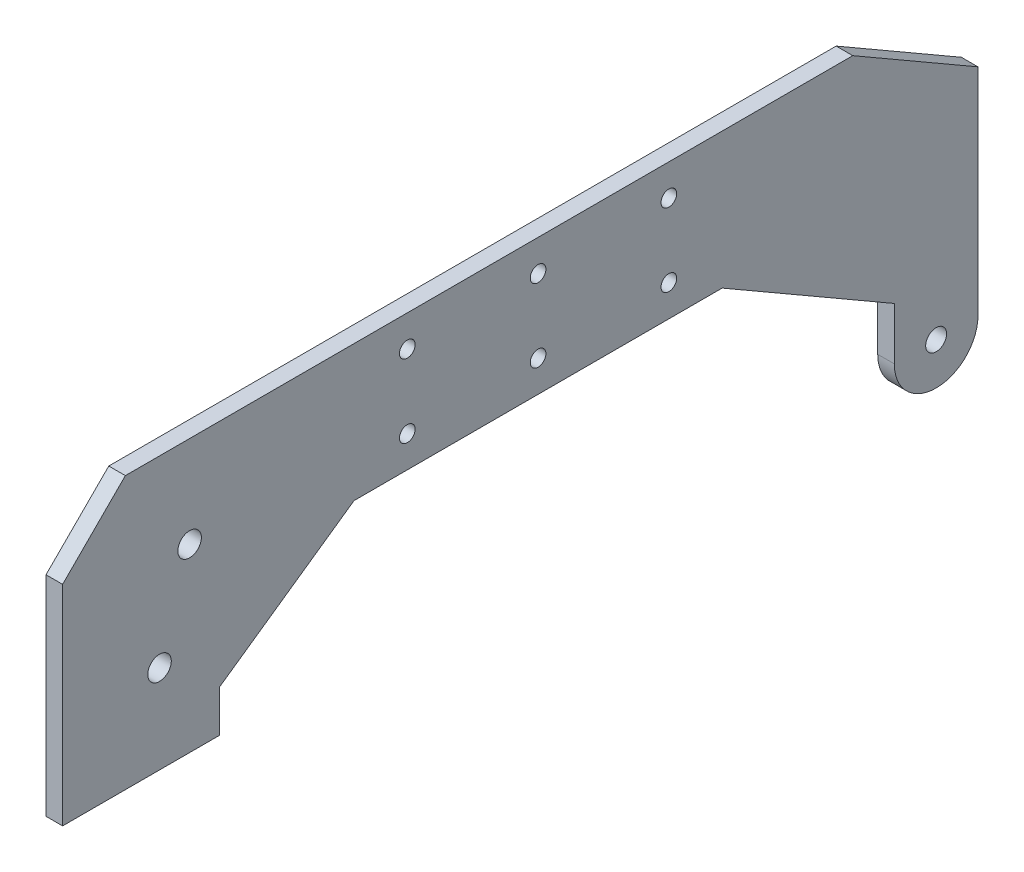
ISO-10303-21;
HEADER;
FILE_DESCRIPTION(('STEP AP214'),'2;1');
FILE_NAME('part.step','',(''),(''),'','','');
FILE_SCHEMA(('AUTOMOTIVE_DESIGN { 1 0 10303 214 1 1 1 1 }'));
ENDSEC;
DATA;
#1=APPLICATION_CONTEXT('core data for automotive mechanical design processes');
#2=APPLICATION_PROTOCOL_DEFINITION('international standard','automotive_design',2000,#1);
#3=PRODUCT_CONTEXT('',#1,'mechanical');
#4=PRODUCT('Part','Part','',(#3));
#5=PRODUCT_RELATED_PRODUCT_CATEGORY('part','',(#4));
#6=PRODUCT_DEFINITION_FORMATION('','',#4);
#7=PRODUCT_DEFINITION_CONTEXT('part definition',#1,'design');
#8=PRODUCT_DEFINITION('design','',#6,#7);
#9=PRODUCT_DEFINITION_SHAPE('','',#8);
#10=(LENGTH_UNIT() NAMED_UNIT(*) SI_UNIT(.MILLI.,.METRE.));
#11=(NAMED_UNIT(*) PLANE_ANGLE_UNIT() SI_UNIT($,.RADIAN.));
#12=(NAMED_UNIT(*) SI_UNIT($,.STERADIAN.) SOLID_ANGLE_UNIT());
#13=UNCERTAINTY_MEASURE_WITH_UNIT(LENGTH_MEASURE(1.E-05),#10,'distance_accuracy_value','');
#14=(GEOMETRIC_REPRESENTATION_CONTEXT(3) GLOBAL_UNCERTAINTY_ASSIGNED_CONTEXT((#13)) GLOBAL_UNIT_ASSIGNED_CONTEXT((#10,
#11,#12)) REPRESENTATION_CONTEXT('',''));
#15=CARTESIAN_POINT('',(0.,0.,0.));
#16=DIRECTION('',(0.,0.,1.));
#17=DIRECTION('',(1.,0.,0.));
#18=AXIS2_PLACEMENT_3D('',#15,#16,#17);
#19=CARTESIAN_POINT('',(3.175,156.62081069656,368.186352930623));
#20=DIRECTION('',(1.,0.,0.));
#21=DIRECTION('',(0.,0.,-1.));
#22=AXIS2_PLACEMENT_3D('',#19,#20,#21);
#23=PLANE('',#22);
#24=CARTESIAN_POINT('',(3.175,191.620810696557,469.287503541848));
#25=DIRECTION('',(1.,0.,0.));
#26=DIRECTION('',(0.,0.,-1.));
#27=AXIS2_PLACEMENT_3D('',#24,#25,#26);
#28=CIRCLE('',#27,1.50000000000374);
#29=CARTESIAN_POINT('',(3.175,191.620810696557,467.787503541845));
#30=VERTEX_POINT('',#29);
#31=EDGE_CURVE('E315',#30,#30,#28,.T.);
#32=ORIENTED_EDGE('',*,*,#31,.F.);
#33=EDGE_LOOP('',(#32));
#34=FACE_BOUND('',#33,.T.);
#35=CARTESIAN_POINT('',(3.175,205.620810696559,469.287503541848));
#36=DIRECTION('',(1.,0.,0.));
#37=DIRECTION('',(0.,0.,-1.));
#38=AXIS2_PLACEMENT_3D('',#35,#36,#37);
#39=CIRCLE('',#38,1.50000000000275);
#40=CARTESIAN_POINT('',(3.175,205.620810696559,467.787503541845));
#41=VERTEX_POINT('',#40);
#42=EDGE_CURVE('E327',#41,#41,#39,.T.);
#43=ORIENTED_EDGE('',*,*,#42,.F.);
#44=EDGE_LOOP('',(#43));
#45=FACE_BOUND('',#44,.T.);
#46=CARTESIAN_POINT('',(3.175,191.620810696557,444.287503541848));
#47=DIRECTION('',(1.,0.,0.));
#48=DIRECTION('',(0.,0.,-1.));
#49=AXIS2_PLACEMENT_3D('',#46,#47,#48);
#50=CIRCLE('',#49,1.50000000000275);
#51=CARTESIAN_POINT('',(3.175,191.620810696557,442.787503541845));
#52=VERTEX_POINT('',#51);
#53=EDGE_CURVE('E339',#52,#52,#50,.T.);
#54=ORIENTED_EDGE('',*,*,#53,.F.);
#55=EDGE_LOOP('',(#54));
#56=FACE_BOUND('',#55,.T.);
#57=CARTESIAN_POINT('',(3.175,194.119148630694,510.908050144466));
#58=DIRECTION('',(1.,0.,0.));
#59=DIRECTION('',(0.,0.,-1.));
#60=AXIS2_PLACEMENT_3D('',#57,#58,#59);
#61=CIRCLE('',#60,2.25000000000048);
#62=CARTESIAN_POINT('',(3.175,194.119148630694,508.658050144465));
#63=VERTEX_POINT('',#62);
#64=EDGE_CURVE('E351',#63,#63,#61,.T.);
#65=ORIENTED_EDGE('',*,*,#64,.F.);
#66=EDGE_LOOP('',(#65));
#67=FACE_BOUND('',#66,.T.);
#68=DIRECTION('',(0.,0.,-1.));
#69=VECTOR('',#68,1.);
#70=CARTESIAN_POINT('',(3.175,159.62081069656,505.186352930625));
#71=LINE('',#70,#69);
#72=CARTESIAN_POINT('',(3.175,159.62081069656,535.186352930625));
#73=VERTEX_POINT('',#72);
#74=CARTESIAN_POINT('',(3.175,159.62081069656,505.186352930625));
#75=VERTEX_POINT('',#74);
#76=EDGE_CURVE('E181',#73,#75,#71,.T.);
#77=ORIENTED_EDGE('',*,*,#76,.T.);
#78=DIRECTION('',(0.,1.,0.));
#79=VECTOR('',#78,1.);
#80=CARTESIAN_POINT('',(3.175,167.62081069656,505.186352930625));
#81=LINE('',#80,#79);
#82=CARTESIAN_POINT('',(3.175,167.62081069656,505.186352930625));
#83=VERTEX_POINT('',#82);
#84=EDGE_CURVE('E109',#75,#83,#81,.T.);
#85=ORIENTED_EDGE('',*,*,#84,.T.);
#86=DIRECTION('',(0.,0.573576436351051,-0.819152044288989));
#87=VECTOR('',#86,1.);
#88=CARTESIAN_POINT('',(3.175,167.62081069656,505.186352930625));
#89=LINE('',#88,#87);
#90=CARTESIAN_POINT('',(3.175,185.620810696557,479.479688809272));
#91=VERTEX_POINT('',#90);
#92=EDGE_CURVE('E208',#83,#91,#89,.T.);
#93=ORIENTED_EDGE('',*,*,#92,.T.);
#94=DIRECTION('',(0.,0.,-1.));
#95=VECTOR('',#94,1.);
#96=CARTESIAN_POINT('',(3.175,185.620810696557,479.479688809272));
#97=LINE('',#96,#95);
#98=CARTESIAN_POINT('',(3.175,185.620810696557,409.095318274426));
#99=VERTEX_POINT('',#98);
#100=EDGE_CURVE('E227',#91,#99,#97,.T.);
#101=ORIENTED_EDGE('',*,*,#100,.T.);
#102=DIRECTION('',(0.,-0.500000000000002,-0.866025403784437));
#103=VECTOR('',#102,1.);
#104=CARTESIAN_POINT('',(3.175,185.620810696557,409.095318274426));
#105=LINE('',#104,#103);
#106=CARTESIAN_POINT('',(3.175,166.62081069656,376.186352930623));
#107=VERTEX_POINT('',#106);
#108=EDGE_CURVE('E224',#99,#107,#105,.T.);
#109=ORIENTED_EDGE('',*,*,#108,.T.);
#110=DIRECTION('',(0.,-1.,0.));
#111=VECTOR('',#110,1.);
#112=CARTESIAN_POINT('',(3.175,156.62081069656,376.186352930623));
#113=LINE('',#112,#111);
#114=CARTESIAN_POINT('',(3.175,156.62081069656,376.186352930623));
#115=VERTEX_POINT('',#114);
#116=EDGE_CURVE('E226',#107,#115,#113,.T.);
#117=ORIENTED_EDGE('',*,*,#116,.T.);
#118=CARTESIAN_POINT('',(3.175,156.62081069656,368.186352930623));
#119=DIRECTION('',(1.,0.,0.));
#120=DIRECTION('',(0.,0.,-1.));
#121=AXIS2_PLACEMENT_3D('',#118,#119,#120);
#122=CIRCLE('',#121,7.99999999999923);
#123=CARTESIAN_POINT('',(3.175,156.62081069656,360.186352930625));
#124=VERTEX_POINT('',#123);
#125=EDGE_CURVE('E229',#115,#124,#122,.T.);
#126=ORIENTED_EDGE('',*,*,#125,.T.);
#127=DIRECTION('',(0.,1.,0.));
#128=VECTOR('',#127,1.);
#129=CARTESIAN_POINT('',(3.175,197.797725232797,360.186352930625));
#130=LINE('',#129,#128);
#131=CARTESIAN_POINT('',(3.175,197.797725232797,360.186352930625));
#132=VERTEX_POINT('',#131);
#133=EDGE_CURVE('E235',#124,#132,#130,.T.);
#134=ORIENTED_EDGE('',*,*,#133,.T.);
#135=DIRECTION('',(0.,0.500000000000003,0.866025403784437));
#136=VECTOR('',#135,1.);
#137=CARTESIAN_POINT('',(3.175,211.62081069656,384.128639271229));
#138=LINE('',#137,#136);
#139=CARTESIAN_POINT('',(3.175,211.62081069656,384.128639271229));
#140=VERTEX_POINT('',#139);
#141=EDGE_CURVE('E140',#132,#140,#138,.T.);
#142=ORIENTED_EDGE('',*,*,#141,.T.);
#143=DIRECTION('',(0.,0.,1.));
#144=VECTOR('',#143,1.);
#145=CARTESIAN_POINT('',(3.175,211.62081069656,384.128639271229));
#146=LINE('',#145,#144);
#147=CARTESIAN_POINT('',(3.175,211.62081069656,523.186352930625));
#148=VERTEX_POINT('',#147);
#149=EDGE_CURVE('E134',#140,#148,#146,.T.);
#150=ORIENTED_EDGE('',*,*,#149,.T.);
#151=DIRECTION('',(0.,-0.707106781186548,0.707106781186547));
#152=VECTOR('',#151,1.);
#153=CARTESIAN_POINT('',(3.175,211.62081069656,523.186352930625));
#154=LINE('',#153,#152);
#155=CARTESIAN_POINT('',(3.175,199.62081069656,535.186352930625));
#156=VERTEX_POINT('',#155);
#157=EDGE_CURVE('E138',#148,#156,#154,.T.);
#158=ORIENTED_EDGE('',*,*,#157,.T.);
#159=DIRECTION('',(0.,-1.,0.));
#160=VECTOR('',#159,1.);
#161=CARTESIAN_POINT('',(3.175,199.62081069656,535.186352930625));
#162=LINE('',#161,#160);
#163=EDGE_CURVE('E54',#156,#73,#162,.T.);
#164=ORIENTED_EDGE('',*,*,#163,.T.);
#165=EDGE_LOOP('',(#77,#85,#93,#101,#109,#117,#126,#134,#142,#150,#158,#164));
#166=FACE_BOUND('',#165,.T.);
#167=CARTESIAN_POINT('',(3.175,156.62081069656,368.186352930623));
#168=DIRECTION('',(1.,0.,0.));
#169=DIRECTION('',(0.,0.,-1.));
#170=AXIS2_PLACEMENT_3D('',#167,#168,#169);
#171=CIRCLE('',#170,2.);
#172=CARTESIAN_POINT('',(3.175,156.62081069656,366.186352930623));
#173=VERTEX_POINT('',#172);
#174=EDGE_CURVE('E162',#173,#173,#171,.T.);
#175=ORIENTED_EDGE('',*,*,#174,.F.);
#176=EDGE_LOOP('',(#175));
#177=FACE_BOUND('',#176,.T.);
#178=CARTESIAN_POINT('',(3.175,176.534985114945,516.656718986153));
#179=DIRECTION('',(1.,0.,0.));
#180=DIRECTION('',(0.,0.,-1.));
#181=AXIS2_PLACEMENT_3D('',#178,#179,#180);
#182=CIRCLE('',#181,2.25000000000048);
#183=CARTESIAN_POINT('',(3.175,176.534985114945,514.406718986152));
#184=VERTEX_POINT('',#183);
#185=EDGE_CURVE('E345',#184,#184,#182,.T.);
#186=ORIENTED_EDGE('',*,*,#185,.F.);
#187=EDGE_LOOP('',(#186));
#188=FACE_BOUND('',#187,.T.);
#189=CARTESIAN_POINT('',(3.175,191.620810696557,419.287503541848));
#190=DIRECTION('',(1.,0.,0.));
#191=DIRECTION('',(0.,0.,-1.));
#192=AXIS2_PLACEMENT_3D('',#189,#190,#191);
#193=CIRCLE('',#192,1.500000000002);
#194=CARTESIAN_POINT('',(3.175,191.620810696557,417.787503541846));
#195=VERTEX_POINT('',#194);
#196=EDGE_CURVE('E333',#195,#195,#193,.T.);
#197=ORIENTED_EDGE('',*,*,#196,.F.);
#198=EDGE_LOOP('',(#197));
#199=FACE_BOUND('',#198,.T.);
#200=CARTESIAN_POINT('',(3.175,205.620810696559,419.287503541848));
#201=DIRECTION('',(1.,0.,0.));
#202=DIRECTION('',(0.,0.,-1.));
#203=AXIS2_PLACEMENT_3D('',#200,#201,#202);
#204=CIRCLE('',#203,1.500000000002);
#205=CARTESIAN_POINT('',(3.175,205.620810696559,417.787503541846));
#206=VERTEX_POINT('',#205);
#207=EDGE_CURVE('E321',#206,#206,#204,.T.);
#208=ORIENTED_EDGE('',*,*,#207,.F.);
#209=EDGE_LOOP('',(#208));
#210=FACE_BOUND('',#209,.T.);
#211=CARTESIAN_POINT('',(3.175,205.620810696559,444.287503541848));
#212=DIRECTION('',(1.,0.,0.));
#213=DIRECTION('',(0.,0.,-1.));
#214=AXIS2_PLACEMENT_3D('',#211,#212,#213);
#215=CIRCLE('',#214,1.50000000000275);
#216=CARTESIAN_POINT('',(3.175,205.620810696559,442.787503541845));
#217=VERTEX_POINT('',#216);
#218=EDGE_CURVE('E306',#217,#217,#215,.T.);
#219=ORIENTED_EDGE('',*,*,#218,.F.);
#220=EDGE_LOOP('',(#219));
#221=FACE_BOUND('',#220,.T.);
#222=ADVANCED_FACE('F37',(#34,#45,#56,#67,#166,#177,#188,#199,#210,#221),#23,.T.);
#223=CARTESIAN_POINT('',(0.,156.62081069656,368.186352930623));
#224=DIRECTION('',(1.,0.,0.));
#225=DIRECTION('',(0.,0.,-1.));
#226=AXIS2_PLACEMENT_3D('',#223,#224,#225);
#227=PLANE('',#226);
#228=DIRECTION('',(0.,0.,-1.));
#229=VECTOR('',#228,1.);
#230=CARTESIAN_POINT('',(0.,159.62081069656,505.186352930625));
#231=LINE('',#230,#229);
#232=CARTESIAN_POINT('',(0.,159.62081069656,535.186352930625));
#233=VERTEX_POINT('',#232);
#234=CARTESIAN_POINT('',(0.,159.62081069656,505.186352930625));
#235=VERTEX_POINT('',#234);
#236=EDGE_CURVE('E158',#233,#235,#231,.T.);
#237=ORIENTED_EDGE('',*,*,#236,.F.);
#238=DIRECTION('',(0.,-1.,0.));
#239=VECTOR('',#238,1.);
#240=CARTESIAN_POINT('',(0.,199.62081069656,535.186352930625));
#241=LINE('',#240,#239);
#242=CARTESIAN_POINT('',(0.,199.62081069656,535.186352930625));
#243=VERTEX_POINT('',#242);
#244=EDGE_CURVE('E101',#243,#233,#241,.T.);
#245=ORIENTED_EDGE('',*,*,#244,.F.);
#246=DIRECTION('',(0.,-0.707106781186548,0.707106781186547));
#247=VECTOR('',#246,1.);
#248=CARTESIAN_POINT('',(0.,211.62081069656,523.186352930625));
#249=LINE('',#248,#247);
#250=CARTESIAN_POINT('',(0.,211.62081069656,523.186352930625));
#251=VERTEX_POINT('',#250);
#252=EDGE_CURVE('E95',#251,#243,#249,.T.);
#253=ORIENTED_EDGE('',*,*,#252,.F.);
#254=DIRECTION('',(0.,0.,1.));
#255=VECTOR('',#254,1.);
#256=CARTESIAN_POINT('',(0.,211.62081069656,384.128639271229));
#257=LINE('',#256,#255);
#258=CARTESIAN_POINT('',(0.,211.62081069656,384.128639271229));
#259=VERTEX_POINT('',#258);
#260=EDGE_CURVE('E148',#259,#251,#257,.T.);
#261=ORIENTED_EDGE('',*,*,#260,.F.);
#262=DIRECTION('',(0.,0.500000000000003,0.866025403784437));
#263=VECTOR('',#262,1.);
#264=CARTESIAN_POINT('',(0.,211.62081069656,384.128639271229));
#265=LINE('',#264,#263);
#266=CARTESIAN_POINT('',(0.,197.797725232797,360.186352930625));
#267=VERTEX_POINT('',#266);
#268=EDGE_CURVE('E176',#267,#259,#265,.T.);
#269=ORIENTED_EDGE('',*,*,#268,.F.);
#270=DIRECTION('',(0.,1.,0.));
#271=VECTOR('',#270,1.);
#272=CARTESIAN_POINT('',(0.,197.797725232797,360.186352930625));
#273=LINE('',#272,#271);
#274=CARTESIAN_POINT('',(0.,156.62081069656,360.186352930625));
#275=VERTEX_POINT('',#274);
#276=EDGE_CURVE('E174',#275,#267,#273,.T.);
#277=ORIENTED_EDGE('',*,*,#276,.F.);
#278=CARTESIAN_POINT('',(0.,156.62081069656,368.186352930623));
#279=DIRECTION('',(1.,0.,0.));
#280=DIRECTION('',(0.,0.,-1.));
#281=AXIS2_PLACEMENT_3D('',#278,#279,#280);
#282=CIRCLE('',#281,7.99999999999923);
#283=CARTESIAN_POINT('',(0.,156.62081069656,376.186352930623));
#284=VERTEX_POINT('',#283);
#285=EDGE_CURVE('E172',#284,#275,#282,.T.);
#286=ORIENTED_EDGE('',*,*,#285,.F.);
#287=DIRECTION('',(0.,-1.,0.));
#288=VECTOR('',#287,1.);
#289=CARTESIAN_POINT('',(0.,156.62081069656,376.186352930623));
#290=LINE('',#289,#288);
#291=CARTESIAN_POINT('',(0.,166.62081069656,376.186352930623));
#292=VERTEX_POINT('',#291);
#293=EDGE_CURVE('E170',#292,#284,#290,.T.);
#294=ORIENTED_EDGE('',*,*,#293,.F.);
#295=DIRECTION('',(0.,-0.500000000000002,-0.866025403784437));
#296=VECTOR('',#295,1.);
#297=CARTESIAN_POINT('',(0.,185.620810696557,409.095318274426));
#298=LINE('',#297,#296);
#299=CARTESIAN_POINT('',(0.,185.620810696557,409.095318274426));
#300=VERTEX_POINT('',#299);
#301=EDGE_CURVE('E168',#300,#292,#298,.T.);
#302=ORIENTED_EDGE('',*,*,#301,.F.);
#303=DIRECTION('',(0.,0.,-1.));
#304=VECTOR('',#303,1.);
#305=CARTESIAN_POINT('',(0.,185.620810696557,479.479688809272));
#306=LINE('',#305,#304);
#307=CARTESIAN_POINT('',(0.,185.620810696557,479.479688809272));
#308=VERTEX_POINT('',#307);
#309=EDGE_CURVE('E166',#308,#300,#306,.T.);
#310=ORIENTED_EDGE('',*,*,#309,.F.);
#311=DIRECTION('',(0.,0.573576436351051,-0.819152044288989));
#312=VECTOR('',#311,1.);
#313=CARTESIAN_POINT('',(0.,167.62081069656,505.186352930625));
#314=LINE('',#313,#312);
#315=CARTESIAN_POINT('',(0.,167.62081069656,505.186352930625));
#316=VERTEX_POINT('',#315);
#317=EDGE_CURVE('E164',#316,#308,#314,.T.);
#318=ORIENTED_EDGE('',*,*,#317,.F.);
#319=DIRECTION('',(0.,1.,0.));
#320=VECTOR('',#319,1.);
#321=CARTESIAN_POINT('',(0.,167.62081069656,505.186352930625));
#322=LINE('',#321,#320);
#323=EDGE_CURVE('E161',#235,#316,#322,.T.);
#324=ORIENTED_EDGE('',*,*,#323,.F.);
#325=EDGE_LOOP('',(#237,#245,#253,#261,#269,#277,#286,#294,#302,#310,#318,#324));
#326=FACE_BOUND('',#325,.T.);
#327=CARTESIAN_POINT('',(0.,156.62081069656,368.186352930623));
#328=DIRECTION('',(1.,0.,0.));
#329=DIRECTION('',(0.,0.,-1.));
#330=AXIS2_PLACEMENT_3D('',#327,#328,#329);
#331=CIRCLE('',#330,2.);
#332=CARTESIAN_POINT('',(0.,156.62081069656,366.186352930623));
#333=VERTEX_POINT('',#332);
#334=EDGE_CURVE('E354',#333,#333,#331,.T.);
#335=ORIENTED_EDGE('',*,*,#334,.T.);
#336=EDGE_LOOP('',(#335));
#337=FACE_BOUND('',#336,.T.);
#338=CARTESIAN_POINT('',(0.,194.119148630694,510.908050144466));
#339=DIRECTION('',(1.,0.,0.));
#340=DIRECTION('',(0.,0.,-1.));
#341=AXIS2_PLACEMENT_3D('',#338,#339,#340);
#342=CIRCLE('',#341,2.25000000000048);
#343=CARTESIAN_POINT('',(0.,194.119148630694,508.658050144465));
#344=VERTEX_POINT('',#343);
#345=EDGE_CURVE('E348',#344,#344,#342,.T.);
#346=ORIENTED_EDGE('',*,*,#345,.T.);
#347=EDGE_LOOP('',(#346));
#348=FACE_BOUND('',#347,.T.);
#349=CARTESIAN_POINT('',(0.,176.534985114945,516.656718986153));
#350=DIRECTION('',(1.,0.,0.));
#351=DIRECTION('',(0.,0.,-1.));
#352=AXIS2_PLACEMENT_3D('',#349,#350,#351);
#353=CIRCLE('',#352,2.25000000000048);
#354=CARTESIAN_POINT('',(0.,176.534985114945,514.406718986152));
#355=VERTEX_POINT('',#354);
#356=EDGE_CURVE('E342',#355,#355,#353,.T.);
#357=ORIENTED_EDGE('',*,*,#356,.T.);
#358=EDGE_LOOP('',(#357));
#359=FACE_BOUND('',#358,.T.);
#360=CARTESIAN_POINT('',(0.,191.620810696557,444.287503541848));
#361=DIRECTION('',(1.,0.,0.));
#362=DIRECTION('',(0.,0.,-1.));
#363=AXIS2_PLACEMENT_3D('',#360,#361,#362);
#364=CIRCLE('',#363,1.50000000000275);
#365=CARTESIAN_POINT('',(0.,191.620810696557,442.787503541845));
#366=VERTEX_POINT('',#365);
#367=EDGE_CURVE('E336',#366,#366,#364,.T.);
#368=ORIENTED_EDGE('',*,*,#367,.T.);
#369=EDGE_LOOP('',(#368));
#370=FACE_BOUND('',#369,.T.);
#371=CARTESIAN_POINT('',(0.,191.620810696557,419.287503541848));
#372=DIRECTION('',(1.,0.,0.));
#373=DIRECTION('',(0.,0.,-1.));
#374=AXIS2_PLACEMENT_3D('',#371,#372,#373);
#375=CIRCLE('',#374,1.500000000002);
#376=CARTESIAN_POINT('',(0.,191.620810696557,417.787503541846));
#377=VERTEX_POINT('',#376);
#378=EDGE_CURVE('E330',#377,#377,#375,.T.);
#379=ORIENTED_EDGE('',*,*,#378,.T.);
#380=EDGE_LOOP('',(#379));
#381=FACE_BOUND('',#380,.T.);
#382=CARTESIAN_POINT('',(0.,205.620810696559,469.287503541848));
#383=DIRECTION('',(1.,0.,0.));
#384=DIRECTION('',(0.,0.,-1.));
#385=AXIS2_PLACEMENT_3D('',#382,#383,#384);
#386=CIRCLE('',#385,1.50000000000275);
#387=CARTESIAN_POINT('',(0.,205.620810696559,467.787503541845));
#388=VERTEX_POINT('',#387);
#389=EDGE_CURVE('E324',#388,#388,#386,.T.);
#390=ORIENTED_EDGE('',*,*,#389,.T.);
#391=EDGE_LOOP('',(#390));
#392=FACE_BOUND('',#391,.T.);
#393=CARTESIAN_POINT('',(0.,205.620810696559,419.287503541848));
#394=DIRECTION('',(1.,0.,0.));
#395=DIRECTION('',(0.,0.,-1.));
#396=AXIS2_PLACEMENT_3D('',#393,#394,#395);
#397=CIRCLE('',#396,1.500000000002);
#398=CARTESIAN_POINT('',(0.,205.620810696559,417.787503541846));
#399=VERTEX_POINT('',#398);
#400=EDGE_CURVE('E318',#399,#399,#397,.T.);
#401=ORIENTED_EDGE('',*,*,#400,.T.);
#402=EDGE_LOOP('',(#401));
#403=FACE_BOUND('',#402,.T.);
#404=CARTESIAN_POINT('',(0.,191.620810696557,469.287503541848));
#405=DIRECTION('',(1.,0.,0.));
#406=DIRECTION('',(0.,0.,-1.));
#407=AXIS2_PLACEMENT_3D('',#404,#405,#406);
#408=CIRCLE('',#407,1.50000000000374);
#409=CARTESIAN_POINT('',(0.,191.620810696557,467.787503541845));
#410=VERTEX_POINT('',#409);
#411=EDGE_CURVE('E312',#410,#410,#408,.T.);
#412=ORIENTED_EDGE('',*,*,#411,.T.);
#413=EDGE_LOOP('',(#412));
#414=FACE_BOUND('',#413,.T.);
#415=CARTESIAN_POINT('',(0.,205.620810696559,444.287503541848));
#416=DIRECTION('',(1.,0.,0.));
#417=DIRECTION('',(0.,0.,-1.));
#418=AXIS2_PLACEMENT_3D('',#415,#416,#417);
#419=CIRCLE('',#418,1.50000000000275);
#420=CARTESIAN_POINT('',(0.,205.620810696559,442.787503541845));
#421=VERTEX_POINT('',#420);
#422=EDGE_CURVE('E309',#421,#421,#419,.T.);
#423=ORIENTED_EDGE('',*,*,#422,.T.);
#424=EDGE_LOOP('',(#423));
#425=FACE_BOUND('',#424,.T.);
#426=ADVANCED_FACE('F212',(#326,#337,#348,#359,#370,#381,#392,#403,#414,#425),#227,.F.);
#427=CARTESIAN_POINT('',(3.175,159.62081069656,505.186352930625));
#428=DIRECTION('',(0.,1.,0.));
#429=DIRECTION('',(0.,0.,1.));
#430=AXIS2_PLACEMENT_3D('',#427,#428,#429);
#431=PLANE('',#430);
#432=ORIENTED_EDGE('',*,*,#236,.T.);
#433=DIRECTION('',(-1.,0.,0.));
#434=VECTOR('',#433,1.);
#435=CARTESIAN_POINT('',(3.175,159.62081069656,505.186352930625));
#436=LINE('',#435,#434);
#437=EDGE_CURVE('E11',#75,#235,#436,.T.);
#438=ORIENTED_EDGE('',*,*,#437,.F.);
#439=ORIENTED_EDGE('',*,*,#76,.F.);
#440=DIRECTION('',(-1.,0.,0.));
#441=VECTOR('',#440,1.);
#442=CARTESIAN_POINT('',(3.175,159.62081069656,535.186352930625));
#443=LINE('',#442,#441);
#444=EDGE_CURVE('E154',#73,#233,#443,.T.);
#445=ORIENTED_EDGE('',*,*,#444,.T.);
#446=EDGE_LOOP('',(#432,#438,#439,#445));
#447=FACE_BOUND('',#446,.T.);
#448=ADVANCED_FACE('F39',(#447),#431,.F.);
#449=CARTESIAN_POINT('',(3.175,167.62081069656,505.186352930625));
#450=DIRECTION('',(0.,0.,1.));
#451=DIRECTION('',(1.,0.,0.));
#452=AXIS2_PLACEMENT_3D('',#449,#450,#451);
#453=PLANE('',#452);
#454=ORIENTED_EDGE('',*,*,#323,.T.);
#455=DIRECTION('',(-1.,0.,0.));
#456=VECTOR('',#455,1.);
#457=CARTESIAN_POINT('',(3.175,167.62081069656,505.186352930625));
#458=LINE('',#457,#456);
#459=EDGE_CURVE('E46',#83,#316,#458,.T.);
#460=ORIENTED_EDGE('',*,*,#459,.F.);
#461=ORIENTED_EDGE('',*,*,#84,.F.);
#462=ORIENTED_EDGE('',*,*,#437,.T.);
#463=EDGE_LOOP('',(#454,#460,#461,#462));
#464=FACE_BOUND('',#463,.T.);
#465=ADVANCED_FACE('F519',(#464),#453,.F.);
#466=CARTESIAN_POINT('',(3.175,167.62081069656,505.186352930625));
#467=DIRECTION('',(0.,0.819152044288989,0.573576436351051));
#468=DIRECTION('',(0.,-0.573576436351051,0.819152044288989));
#469=AXIS2_PLACEMENT_3D('',#466,#467,#468);
#470=PLANE('',#469);
#471=ORIENTED_EDGE('',*,*,#317,.T.);
#472=DIRECTION('',(-1.,0.,0.));
#473=VECTOR('',#472,1.);
#474=CARTESIAN_POINT('',(3.175,185.620810696557,479.479688809272));
#475=LINE('',#474,#473);
#476=EDGE_CURVE('E200',#91,#308,#475,.T.);
#477=ORIENTED_EDGE('',*,*,#476,.F.);
#478=ORIENTED_EDGE('',*,*,#92,.F.);
#479=ORIENTED_EDGE('',*,*,#459,.T.);
#480=EDGE_LOOP('',(#471,#477,#478,#479));
#481=FACE_BOUND('',#480,.T.);
#482=ADVANCED_FACE('F206',(#481),#470,.F.);
#483=CARTESIAN_POINT('',(3.175,185.620810696557,479.479688809272));
#484=DIRECTION('',(0.,1.,0.));
#485=DIRECTION('',(0.,0.,1.));
#486=AXIS2_PLACEMENT_3D('',#483,#484,#485);
#487=PLANE('',#486);
#488=ORIENTED_EDGE('',*,*,#309,.T.);
#489=DIRECTION('',(-1.,0.,0.));
#490=VECTOR('',#489,1.);
#491=CARTESIAN_POINT('',(3.175,185.620810696557,409.095318274426));
#492=LINE('',#491,#490);
#493=EDGE_CURVE('E197',#99,#300,#492,.T.);
#494=ORIENTED_EDGE('',*,*,#493,.F.);
#495=ORIENTED_EDGE('',*,*,#100,.F.);
#496=ORIENTED_EDGE('',*,*,#476,.T.);
#497=EDGE_LOOP('',(#488,#494,#495,#496));
#498=FACE_BOUND('',#497,.T.);
#499=ADVANCED_FACE('F218',(#498),#487,.F.);
#500=CARTESIAN_POINT('',(3.175,185.620810696557,409.095318274426));
#501=DIRECTION('',(0.,0.866025403784437,-0.500000000000002));
#502=DIRECTION('',(0.,0.500000000000002,0.866025403784437));
#503=AXIS2_PLACEMENT_3D('',#500,#501,#502);
#504=PLANE('',#503);
#505=ORIENTED_EDGE('',*,*,#301,.T.);
#506=DIRECTION('',(-1.,0.,0.));
#507=VECTOR('',#506,1.);
#508=CARTESIAN_POINT('',(3.175,166.62081069656,376.186352930623));
#509=LINE('',#508,#507);
#510=EDGE_CURVE('E194',#107,#292,#509,.T.);
#511=ORIENTED_EDGE('',*,*,#510,.F.);
#512=ORIENTED_EDGE('',*,*,#108,.F.);
#513=ORIENTED_EDGE('',*,*,#493,.T.);
#514=EDGE_LOOP('',(#505,#511,#512,#513));
#515=FACE_BOUND('',#514,.T.);
#516=ADVANCED_FACE('F222',(#515),#504,.F.);
#517=CARTESIAN_POINT('',(3.175,156.62081069656,376.186352930623));
#518=DIRECTION('',(0.,0.,-1.));
#519=DIRECTION('',(-1.,0.,0.));
#520=AXIS2_PLACEMENT_3D('',#517,#518,#519);
#521=PLANE('',#520);
#522=ORIENTED_EDGE('',*,*,#293,.T.);
#523=DIRECTION('',(-1.,0.,0.));
#524=VECTOR('',#523,1.);
#525=CARTESIAN_POINT('',(3.175,156.62081069656,376.186352930623));
#526=LINE('',#525,#524);
#527=EDGE_CURVE('E191',#115,#284,#526,.T.);
#528=ORIENTED_EDGE('',*,*,#527,.F.);
#529=ORIENTED_EDGE('',*,*,#116,.F.);
#530=ORIENTED_EDGE('',*,*,#510,.T.);
#531=EDGE_LOOP('',(#522,#528,#529,#530));
#532=FACE_BOUND('',#531,.T.);
#533=ADVANCED_FACE('F480',(#532),#521,.F.);
#534=CARTESIAN_POINT('',(3.175,156.62081069656,368.186352930623));
#535=DIRECTION('',(-1.,0.,0.));
#536=DIRECTION('',(0.,0.,1.));
#537=AXIS2_PLACEMENT_3D('',#534,#535,#536);
#538=CYLINDRICAL_SURFACE('',#537,7.99999999999923);
#539=ORIENTED_EDGE('',*,*,#285,.T.);
#540=DIRECTION('',(-1.,0.,0.));
#541=VECTOR('',#540,1.);
#542=CARTESIAN_POINT('',(3.175,156.62081069656,360.186352930625));
#543=LINE('',#542,#541);
#544=EDGE_CURVE('E188',#124,#275,#543,.T.);
#545=ORIENTED_EDGE('',*,*,#544,.F.);
#546=ORIENTED_EDGE('',*,*,#125,.F.);
#547=ORIENTED_EDGE('',*,*,#527,.T.);
#548=EDGE_LOOP('',(#539,#545,#546,#547));
#549=FACE_BOUND('',#548,.T.);
#550=ADVANCED_FACE('F470',(#549),#538,.T.);
#551=CARTESIAN_POINT('',(3.175,197.797725232797,360.186352930625));
#552=DIRECTION('',(0.,0.,1.));
#553=DIRECTION('',(1.,0.,0.));
#554=AXIS2_PLACEMENT_3D('',#551,#552,#553);
#555=PLANE('',#554);
#556=ORIENTED_EDGE('',*,*,#276,.T.);
#557=DIRECTION('',(-1.,0.,0.));
#558=VECTOR('',#557,1.);
#559=CARTESIAN_POINT('',(3.175,197.797725232797,360.186352930625));
#560=LINE('',#559,#558);
#561=EDGE_CURVE('E185',#132,#267,#560,.T.);
#562=ORIENTED_EDGE('',*,*,#561,.F.);
#563=ORIENTED_EDGE('',*,*,#133,.F.);
#564=ORIENTED_EDGE('',*,*,#544,.T.);
#565=EDGE_LOOP('',(#556,#562,#563,#564));
#566=FACE_BOUND('',#565,.T.);
#567=ADVANCED_FACE('F241',(#566),#555,.F.);
#568=CARTESIAN_POINT('',(3.175,211.62081069656,384.128639271229));
#569=DIRECTION('',(0.,-0.866025403784437,0.500000000000003));
#570=DIRECTION('',(0.,-0.500000000000003,-0.866025403784437));
#571=AXIS2_PLACEMENT_3D('',#568,#569,#570);
#572=PLANE('',#571);
#573=ORIENTED_EDGE('',*,*,#268,.T.);
#574=DIRECTION('',(-1.,0.,0.));
#575=VECTOR('',#574,1.);
#576=CARTESIAN_POINT('',(3.175,211.62081069656,384.128639271229));
#577=LINE('',#576,#575);
#578=EDGE_CURVE('E149',#140,#259,#577,.T.);
#579=ORIENTED_EDGE('',*,*,#578,.F.);
#580=ORIENTED_EDGE('',*,*,#141,.F.);
#581=ORIENTED_EDGE('',*,*,#561,.T.);
#582=EDGE_LOOP('',(#573,#579,#580,#581));
#583=FACE_BOUND('',#582,.T.);
#584=ADVANCED_FACE('F245',(#583),#572,.F.);
#585=CARTESIAN_POINT('',(3.175,211.62081069656,384.128639271229));
#586=DIRECTION('',(0.,-1.,0.));
#587=DIRECTION('',(0.,0.,-1.));
#588=AXIS2_PLACEMENT_3D('',#585,#586,#587);
#589=PLANE('',#588);
#590=ORIENTED_EDGE('',*,*,#260,.T.);
#591=DIRECTION('',(-1.,0.,0.));
#592=VECTOR('',#591,1.);
#593=CARTESIAN_POINT('',(3.175,211.62081069656,523.186352930625));
#594=LINE('',#593,#592);
#595=EDGE_CURVE('E145',#148,#251,#594,.T.);
#596=ORIENTED_EDGE('',*,*,#595,.F.);
#597=ORIENTED_EDGE('',*,*,#149,.F.);
#598=ORIENTED_EDGE('',*,*,#578,.T.);
#599=EDGE_LOOP('',(#590,#596,#597,#598));
#600=FACE_BOUND('',#599,.T.);
#601=ADVANCED_FACE('F146',(#600),#589,.F.);
#602=CARTESIAN_POINT('',(3.175,211.62081069656,523.186352930625));
#603=DIRECTION('',(0.,-0.707106781186547,-0.707106781186548));
#604=DIRECTION('',(0.,0.707106781186548,-0.707106781186547));
#605=AXIS2_PLACEMENT_3D('',#602,#603,#604);
#606=PLANE('',#605);
#607=ORIENTED_EDGE('',*,*,#252,.T.);
#608=DIRECTION('',(-1.,0.,0.));
#609=VECTOR('',#608,1.);
#610=CARTESIAN_POINT('',(3.175,199.62081069656,535.186352930625));
#611=LINE('',#610,#609);
#612=EDGE_CURVE('E150',#156,#243,#611,.T.);
#613=ORIENTED_EDGE('',*,*,#612,.F.);
#614=ORIENTED_EDGE('',*,*,#157,.F.);
#615=ORIENTED_EDGE('',*,*,#595,.T.);
#616=EDGE_LOOP('',(#607,#613,#614,#615));
#617=FACE_BOUND('',#616,.T.);
#618=ADVANCED_FACE('F152',(#617),#606,.F.);
#619=CARTESIAN_POINT('',(3.175,199.62081069656,535.186352930625));
#620=DIRECTION('',(0.,0.,-1.));
#621=DIRECTION('',(-1.,0.,0.));
#622=AXIS2_PLACEMENT_3D('',#619,#620,#621);
#623=PLANE('',#622);
#624=ORIENTED_EDGE('',*,*,#244,.T.);
#625=ORIENTED_EDGE('',*,*,#444,.F.);
#626=ORIENTED_EDGE('',*,*,#163,.F.);
#627=ORIENTED_EDGE('',*,*,#612,.T.);
#628=EDGE_LOOP('',(#624,#625,#626,#627));
#629=FACE_BOUND('',#628,.T.);
#630=ADVANCED_FACE('F249',(#629),#623,.F.);
#631=CARTESIAN_POINT('',(3.175,156.62081069656,368.186352930623));
#632=DIRECTION('',(-1.,0.,0.));
#633=DIRECTION('',(0.,0.,1.));
#634=AXIS2_PLACEMENT_3D('',#631,#632,#633);
#635=CYLINDRICAL_SURFACE('',#634,2.);
#636=ORIENTED_EDGE('',*,*,#174,.T.);
#637=EDGE_LOOP('',(#636));
#638=FACE_BOUND('',#637,.T.);
#639=ORIENTED_EDGE('',*,*,#334,.F.);
#640=EDGE_LOOP('',(#639));
#641=FACE_BOUND('',#640,.T.);
#642=ADVANCED_FACE('F251',(#638,#641),#635,.F.);
#643=CARTESIAN_POINT('',(3.175,194.119148630694,510.908050144466));
#644=DIRECTION('',(-1.,0.,0.));
#645=DIRECTION('',(0.,0.,1.));
#646=AXIS2_PLACEMENT_3D('',#643,#644,#645);
#647=CYLINDRICAL_SURFACE('',#646,2.25000000000048);
#648=ORIENTED_EDGE('',*,*,#64,.T.);
#649=EDGE_LOOP('',(#648));
#650=FACE_BOUND('',#649,.T.);
#651=ORIENTED_EDGE('',*,*,#345,.F.);
#652=EDGE_LOOP('',(#651));
#653=FACE_BOUND('',#652,.T.);
#654=ADVANCED_FACE('F257',(#650,#653),#647,.F.);
#655=CARTESIAN_POINT('',(3.175,176.534985114945,516.656718986153));
#656=DIRECTION('',(-1.,0.,0.));
#657=DIRECTION('',(0.,0.,1.));
#658=AXIS2_PLACEMENT_3D('',#655,#656,#657);
#659=CYLINDRICAL_SURFACE('',#658,2.25000000000048);
#660=ORIENTED_EDGE('',*,*,#185,.T.);
#661=EDGE_LOOP('',(#660));
#662=FACE_BOUND('',#661,.T.);
#663=ORIENTED_EDGE('',*,*,#356,.F.);
#664=EDGE_LOOP('',(#663));
#665=FACE_BOUND('',#664,.T.);
#666=ADVANCED_FACE('F273',(#662,#665),#659,.F.);
#667=CARTESIAN_POINT('',(3.175,191.620810696557,444.287503541848));
#668=DIRECTION('',(-1.,0.,0.));
#669=DIRECTION('',(0.,0.,1.));
#670=AXIS2_PLACEMENT_3D('',#667,#668,#669);
#671=CYLINDRICAL_SURFACE('',#670,1.50000000000275);
#672=ORIENTED_EDGE('',*,*,#53,.T.);
#673=EDGE_LOOP('',(#672));
#674=FACE_BOUND('',#673,.T.);
#675=ORIENTED_EDGE('',*,*,#367,.F.);
#676=EDGE_LOOP('',(#675));
#677=FACE_BOUND('',#676,.T.);
#678=ADVANCED_FACE('F277',(#674,#677),#671,.F.);
#679=CARTESIAN_POINT('',(3.175,191.620810696557,419.287503541848));
#680=DIRECTION('',(-1.,0.,0.));
#681=DIRECTION('',(0.,0.,1.));
#682=AXIS2_PLACEMENT_3D('',#679,#680,#681);
#683=CYLINDRICAL_SURFACE('',#682,1.500000000002);
#684=ORIENTED_EDGE('',*,*,#196,.T.);
#685=EDGE_LOOP('',(#684));
#686=FACE_BOUND('',#685,.T.);
#687=ORIENTED_EDGE('',*,*,#378,.F.);
#688=EDGE_LOOP('',(#687));
#689=FACE_BOUND('',#688,.T.);
#690=ADVANCED_FACE('F281',(#686,#689),#683,.F.);
#691=CARTESIAN_POINT('',(3.175,205.620810696559,469.287503541848));
#692=DIRECTION('',(-1.,0.,0.));
#693=DIRECTION('',(0.,0.,1.));
#694=AXIS2_PLACEMENT_3D('',#691,#692,#693);
#695=CYLINDRICAL_SURFACE('',#694,1.50000000000275);
#696=ORIENTED_EDGE('',*,*,#42,.T.);
#697=EDGE_LOOP('',(#696));
#698=FACE_BOUND('',#697,.T.);
#699=ORIENTED_EDGE('',*,*,#389,.F.);
#700=EDGE_LOOP('',(#699));
#701=FACE_BOUND('',#700,.T.);
#702=ADVANCED_FACE('F285',(#698,#701),#695,.F.);
#703=CARTESIAN_POINT('',(3.175,205.620810696559,419.287503541848));
#704=DIRECTION('',(-1.,0.,0.));
#705=DIRECTION('',(0.,0.,1.));
#706=AXIS2_PLACEMENT_3D('',#703,#704,#705);
#707=CYLINDRICAL_SURFACE('',#706,1.500000000002);
#708=ORIENTED_EDGE('',*,*,#207,.T.);
#709=EDGE_LOOP('',(#708));
#710=FACE_BOUND('',#709,.T.);
#711=ORIENTED_EDGE('',*,*,#400,.F.);
#712=EDGE_LOOP('',(#711));
#713=FACE_BOUND('',#712,.T.);
#714=ADVANCED_FACE('F289',(#710,#713),#707,.F.);
#715=CARTESIAN_POINT('',(3.175,191.620810696557,469.287503541848));
#716=DIRECTION('',(-1.,0.,0.));
#717=DIRECTION('',(0.,0.,1.));
#718=AXIS2_PLACEMENT_3D('',#715,#716,#717);
#719=CYLINDRICAL_SURFACE('',#718,1.50000000000374);
#720=ORIENTED_EDGE('',*,*,#31,.T.);
#721=EDGE_LOOP('',(#720));
#722=FACE_BOUND('',#721,.T.);
#723=ORIENTED_EDGE('',*,*,#411,.F.);
#724=EDGE_LOOP('',(#723));
#725=FACE_BOUND('',#724,.T.);
#726=ADVANCED_FACE('F293',(#722,#725),#719,.F.);
#727=CARTESIAN_POINT('',(3.175,205.620810696559,444.287503541848));
#728=DIRECTION('',(-1.,0.,0.));
#729=DIRECTION('',(0.,0.,1.));
#730=AXIS2_PLACEMENT_3D('',#727,#728,#729);
#731=CYLINDRICAL_SURFACE('',#730,1.50000000000275);
#732=ORIENTED_EDGE('',*,*,#218,.T.);
#733=EDGE_LOOP('',(#732));
#734=FACE_BOUND('',#733,.T.);
#735=ORIENTED_EDGE('',*,*,#422,.F.);
#736=EDGE_LOOP('',(#735));
#737=FACE_BOUND('',#736,.T.);
#738=ADVANCED_FACE('F297',(#734,#737),#731,.F.);
#739=CLOSED_SHELL('',(#222,#426,#448,#465,#482,#499,#516,#533,#550,#567,#584,#601,#618,#630,
#642,#654,#666,#678,#690,#702,#714,#726,#738));
#740=MANIFOLD_SOLID_BREP('B2',#739);
#741=ADVANCED_BREP_SHAPE_REPRESENTATION('',(#18,#740),#14);
#742=SHAPE_DEFINITION_REPRESENTATION(#9,#741);
ENDSEC;
END-ISO-10303-21;
